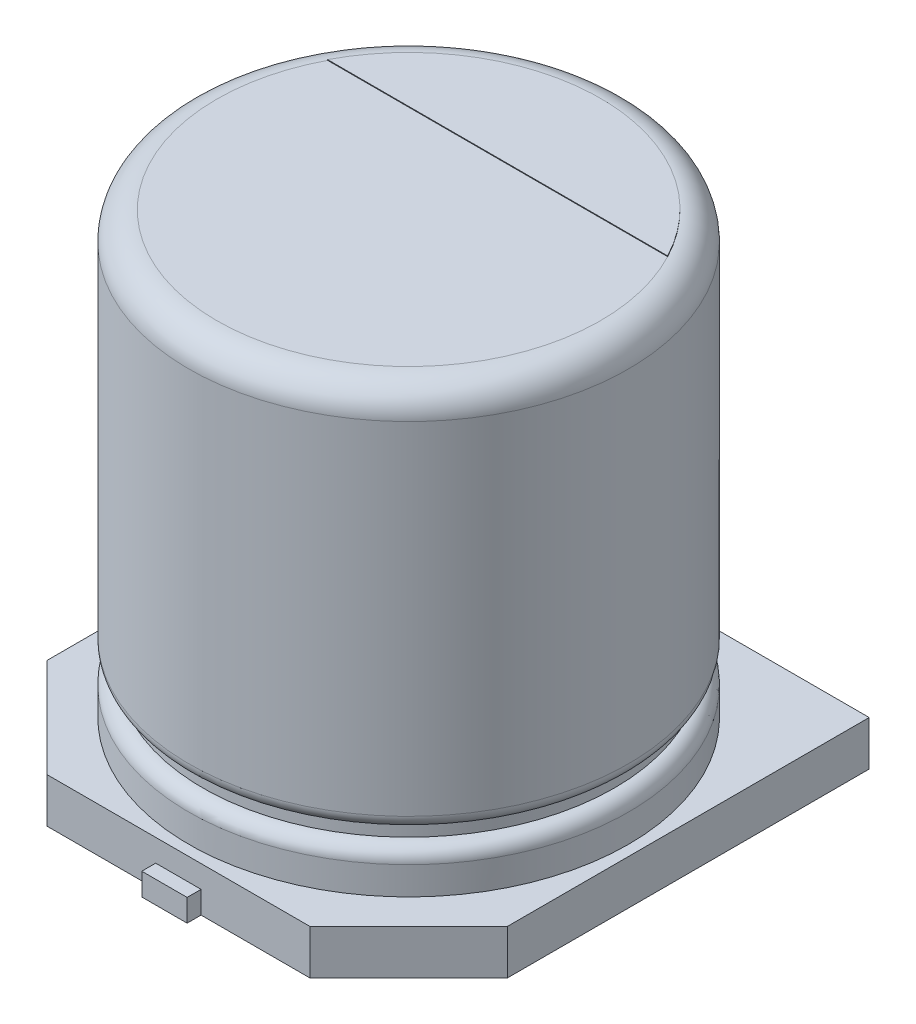
ISO-10303-21;
HEADER;
FILE_DESCRIPTION(('STEP AP214'),'2;1');
FILE_NAME('part.step','',(''),(''),'','','');
FILE_SCHEMA(('AUTOMOTIVE_DESIGN { 1 0 10303 214 1 1 1 1 }'));
ENDSEC;
DATA;
#1=APPLICATION_CONTEXT('core data for automotive mechanical design processes');
#2=APPLICATION_PROTOCOL_DEFINITION('international standard','automotive_design',2000,#1);
#3=PRODUCT_CONTEXT('',#1,'mechanical');
#4=PRODUCT('Part','Part','',(#3));
#5=PRODUCT_RELATED_PRODUCT_CATEGORY('part','',(#4));
#6=PRODUCT_DEFINITION_FORMATION('','',#4);
#7=PRODUCT_DEFINITION_CONTEXT('part definition',#1,'design');
#8=PRODUCT_DEFINITION('design','',#6,#7);
#9=PRODUCT_DEFINITION_SHAPE('','',#8);
#10=(LENGTH_UNIT() NAMED_UNIT(*) SI_UNIT(.MILLI.,.METRE.));
#11=(NAMED_UNIT(*) PLANE_ANGLE_UNIT() SI_UNIT($,.RADIAN.));
#12=(NAMED_UNIT(*) SI_UNIT($,.STERADIAN.) SOLID_ANGLE_UNIT());
#13=UNCERTAINTY_MEASURE_WITH_UNIT(LENGTH_MEASURE(1.E-05),#10,'distance_accuracy_value','');
#14=(GEOMETRIC_REPRESENTATION_CONTEXT(3) GLOBAL_UNCERTAINTY_ASSIGNED_CONTEXT((#13)) GLOBAL_UNIT_ASSIGNED_CONTEXT((#10,
#11,#12)) REPRESENTATION_CONTEXT('',''));
#15=CARTESIAN_POINT('',(0.,0.,0.));
#16=DIRECTION('',(0.,0.,1.));
#17=DIRECTION('',(1.,0.,0.));
#18=AXIS2_PLACEMENT_3D('',#15,#16,#17);
#19=CARTESIAN_POINT('',(0.,-0.64,0.));
#20=DIRECTION('',(0.,-1.,0.));
#21=DIRECTION('',(1.,0.,0.));
#22=AXIS2_PLACEMENT_3D('',#19,#20,#21);
#23=PLANE('',#22);
#24=DIRECTION('',(-1.,0.,0.));
#25=VECTOR('',#24,1.);
#26=CARTESIAN_POINT('',(1.88578643762691,-0.64,3.3));
#27=LINE('',#26,#25);
#28=CARTESIAN_POINT('',(1.88578643762691,-0.64,3.3));
#29=VERTEX_POINT('',#28);
#30=CARTESIAN_POINT('',(0.325,-0.64,3.3));
#31=VERTEX_POINT('',#30);
#32=EDGE_CURVE('E238',#29,#31,#27,.T.);
#33=ORIENTED_EDGE('',*,*,#32,.T.);
#34=DIRECTION('',(0.,0.,-1.));
#35=VECTOR('',#34,1.);
#36=CARTESIAN_POINT('',(0.324999999999999,-0.64,0.));
#37=LINE('',#36,#35);
#38=CARTESIAN_POINT('',(0.325,-0.64,0.9));
#39=VERTEX_POINT('',#38);
#40=EDGE_CURVE('E11',#31,#39,#37,.T.);
#41=ORIENTED_EDGE('',*,*,#40,.T.);
#42=DIRECTION('',(-1.,0.,0.));
#43=VECTOR('',#42,1.);
#44=CARTESIAN_POINT('',(0.,-0.64,0.9));
#45=LINE('',#44,#43);
#46=CARTESIAN_POINT('',(-0.325,-0.64,0.9));
#47=VERTEX_POINT('',#46);
#48=EDGE_CURVE('E45',#39,#47,#45,.T.);
#49=ORIENTED_EDGE('',*,*,#48,.T.);
#50=DIRECTION('',(0.,0.,1.));
#51=VECTOR('',#50,1.);
#52=CARTESIAN_POINT('',(-0.325,-0.64,0.));
#53=LINE('',#52,#51);
#54=CARTESIAN_POINT('',(-0.324999999999999,-0.64,3.3));
#55=VERTEX_POINT('',#54);
#56=EDGE_CURVE('E317',#47,#55,#53,.T.);
#57=ORIENTED_EDGE('',*,*,#56,.T.);
#58=CARTESIAN_POINT('',(-1.88578643762691,-0.64,3.3));
#59=VERTEX_POINT('',#58);
#60=EDGE_CURVE('E237',#55,#59,#27,.T.);
#61=ORIENTED_EDGE('',*,*,#60,.T.);
#62=DIRECTION('',(-0.707106781186546,0.,-0.707106781186549));
#63=VECTOR('',#62,1.);
#64=CARTESIAN_POINT('',(-1.88578643762691,-0.64,3.3));
#65=LINE('',#64,#63);
#66=CARTESIAN_POINT('',(-3.3,-0.64,1.8857864376269));
#67=VERTEX_POINT('',#66);
#68=EDGE_CURVE('E240',#59,#67,#65,.T.);
#69=ORIENTED_EDGE('',*,*,#68,.T.);
#70=DIRECTION('',(0.,0.,-1.));
#71=VECTOR('',#70,1.);
#72=CARTESIAN_POINT('',(-3.3,-0.64,1.8857864376269));
#73=LINE('',#72,#71);
#74=CARTESIAN_POINT('',(-3.3,-0.64,-3.3));
#75=VERTEX_POINT('',#74);
#76=EDGE_CURVE('E225',#67,#75,#73,.T.);
#77=ORIENTED_EDGE('',*,*,#76,.T.);
#78=DIRECTION('',(1.,0.,0.));
#79=VECTOR('',#78,1.);
#80=CARTESIAN_POINT('',(-3.3,-0.64,-3.3));
#81=LINE('',#80,#79);
#82=CARTESIAN_POINT('',(-0.324999999999999,-0.64,-3.3));
#83=VERTEX_POINT('',#82);
#84=EDGE_CURVE('E230',#75,#83,#81,.T.);
#85=ORIENTED_EDGE('',*,*,#84,.T.);
#86=DIRECTION('',(0.,0.,1.));
#87=VECTOR('',#86,1.);
#88=CARTESIAN_POINT('',(-0.325,-0.64,0.));
#89=LINE('',#88,#87);
#90=CARTESIAN_POINT('',(-0.325,-0.64,-0.9));
#91=VERTEX_POINT('',#90);
#92=EDGE_CURVE('E314',#83,#91,#89,.T.);
#93=ORIENTED_EDGE('',*,*,#92,.T.);
#94=DIRECTION('',(1.,0.,0.));
#95=VECTOR('',#94,1.);
#96=CARTESIAN_POINT('',(0.,-0.64,-0.9));
#97=LINE('',#96,#95);
#98=CARTESIAN_POINT('',(0.325,-0.64,-0.9));
#99=VERTEX_POINT('',#98);
#100=EDGE_CURVE('E307',#91,#99,#97,.T.);
#101=ORIENTED_EDGE('',*,*,#100,.T.);
#102=DIRECTION('',(0.,0.,-1.));
#103=VECTOR('',#102,1.);
#104=CARTESIAN_POINT('',(0.324999999999999,-0.64,0.));
#105=LINE('',#104,#103);
#106=CARTESIAN_POINT('',(0.325,-0.64,-3.3));
#107=VERTEX_POINT('',#106);
#108=EDGE_CURVE('E311',#99,#107,#105,.T.);
#109=ORIENTED_EDGE('',*,*,#108,.T.);
#110=CARTESIAN_POINT('',(3.3,-0.64,-3.3));
#111=VERTEX_POINT('',#110);
#112=EDGE_CURVE('E228',#107,#111,#81,.T.);
#113=ORIENTED_EDGE('',*,*,#112,.T.);
#114=DIRECTION('',(0.,0.,1.));
#115=VECTOR('',#114,1.);
#116=CARTESIAN_POINT('',(3.3,-0.64,-3.3));
#117=LINE('',#116,#115);
#118=CARTESIAN_POINT('',(3.3,-0.64,1.8857864376269));
#119=VERTEX_POINT('',#118);
#120=EDGE_CURVE('E233',#111,#119,#117,.T.);
#121=ORIENTED_EDGE('',*,*,#120,.T.);
#122=DIRECTION('',(-0.707106781186546,0.,0.707106781186549));
#123=VECTOR('',#122,1.);
#124=CARTESIAN_POINT('',(3.3,-0.64,1.8857864376269));
#125=LINE('',#124,#123);
#126=EDGE_CURVE('E235',#119,#29,#125,.T.);
#127=ORIENTED_EDGE('',*,*,#126,.T.);
#128=EDGE_LOOP('',(#33,#41,#49,#57,#61,#69,#77,#85,#93,#101,#109,#113,#121,#127));
#129=FACE_BOUND('',#128,.T.);
#130=ADVANCED_FACE('F36',(#129),#23,.T.);
#131=ORIENTED_EDGE('',*,*,#40,.F.);
#132=DIRECTION('',(0.,0.,1.));
#133=VECTOR('',#132,1.);
#134=CARTESIAN_POINT('',(0.325,-0.64,0.9));
#135=LINE('',#134,#133);
#136=CARTESIAN_POINT('',(0.325,-0.64,3.5));
#137=VERTEX_POINT('',#136);
#138=EDGE_CURVE('E156',#31,#137,#135,.T.);
#139=ORIENTED_EDGE('',*,*,#138,.T.);
#140=DIRECTION('',(-1.,0.,0.));
#141=VECTOR('',#140,1.);
#142=CARTESIAN_POINT('',(-0.324999999999999,-0.64,3.5));
#143=LINE('',#142,#141);
#144=CARTESIAN_POINT('',(-0.324999999999999,-0.64,3.5));
#145=VERTEX_POINT('',#144);
#146=EDGE_CURVE('E161',#137,#145,#143,.T.);
#147=ORIENTED_EDGE('',*,*,#146,.T.);
#148=DIRECTION('',(0.,0.,-1.));
#149=VECTOR('',#148,1.);
#150=CARTESIAN_POINT('',(-0.325,-0.64,0.9));
#151=LINE('',#150,#149);
#152=EDGE_CURVE('E180',#145,#55,#151,.T.);
#153=ORIENTED_EDGE('',*,*,#152,.T.);
#154=ORIENTED_EDGE('',*,*,#56,.F.);
#155=ORIENTED_EDGE('',*,*,#48,.F.);
#156=EDGE_LOOP('',(#131,#139,#147,#153,#154,#155));
#157=FACE_BOUND('',#156,.T.);
#158=ADVANCED_FACE('F158',(#157),#23,.T.);
#159=ORIENTED_EDGE('',*,*,#92,.F.);
#160=DIRECTION('',(0.,0.,-1.));
#161=VECTOR('',#160,1.);
#162=CARTESIAN_POINT('',(-0.325,-0.64,-0.9));
#163=LINE('',#162,#161);
#164=CARTESIAN_POINT('',(-0.324999999999999,-0.64,-3.5));
#165=VERTEX_POINT('',#164);
#166=EDGE_CURVE('E190',#83,#165,#163,.T.);
#167=ORIENTED_EDGE('',*,*,#166,.T.);
#168=DIRECTION('',(1.,0.,0.));
#169=VECTOR('',#168,1.);
#170=CARTESIAN_POINT('',(-0.324999999999999,-0.64,-3.5));
#171=LINE('',#170,#169);
#172=CARTESIAN_POINT('',(0.325,-0.64,-3.5));
#173=VERTEX_POINT('',#172);
#174=EDGE_CURVE('E192',#165,#173,#171,.T.);
#175=ORIENTED_EDGE('',*,*,#174,.T.);
#176=DIRECTION('',(0.,0.,1.));
#177=VECTOR('',#176,1.);
#178=CARTESIAN_POINT('',(0.325,-0.64,-0.9));
#179=LINE('',#178,#177);
#180=EDGE_CURVE('E195',#173,#107,#179,.T.);
#181=ORIENTED_EDGE('',*,*,#180,.T.);
#182=ORIENTED_EDGE('',*,*,#108,.F.);
#183=ORIENTED_EDGE('',*,*,#100,.F.);
#184=EDGE_LOOP('',(#159,#167,#175,#181,#182,#183));
#185=FACE_BOUND('',#184,.T.);
#186=ADVANCED_FACE('F372',(#185),#23,.T.);
#187=CARTESIAN_POINT('',(1.88578643762691,-0.64,3.3));
#188=DIRECTION('',(0.,0.,-1.));
#189=DIRECTION('',(-1.,0.,0.));
#190=AXIS2_PLACEMENT_3D('',#187,#188,#189);
#191=PLANE('',#190);
#192=DIRECTION('',(0.,-1.,0.));
#193=VECTOR('',#192,1.);
#194=CARTESIAN_POINT('',(-0.325,-0.32,3.3));
#195=LINE('',#194,#193);
#196=CARTESIAN_POINT('',(-0.324999999999999,-0.32,3.3));
#197=VERTEX_POINT('',#196);
#198=EDGE_CURVE('E212',#197,#55,#195,.T.);
#199=ORIENTED_EDGE('',*,*,#198,.F.);
#200=DIRECTION('',(-1.,0.,0.));
#201=VECTOR('',#200,1.);
#202=CARTESIAN_POINT('',(0.,-0.32,3.3));
#203=LINE('',#202,#201);
#204=CARTESIAN_POINT('',(0.325,-0.32,3.3));
#205=VERTEX_POINT('',#204);
#206=EDGE_CURVE('E209',#205,#197,#203,.T.);
#207=ORIENTED_EDGE('',*,*,#206,.F.);
#208=DIRECTION('',(0.,-1.,0.));
#209=VECTOR('',#208,1.);
#210=CARTESIAN_POINT('',(0.324999999999999,-0.32,3.3));
#211=LINE('',#210,#209);
#212=EDGE_CURVE('E211',#205,#31,#211,.T.);
#213=ORIENTED_EDGE('',*,*,#212,.T.);
#214=ORIENTED_EDGE('',*,*,#32,.F.);
#215=DIRECTION('',(0.,1.,0.));
#216=VECTOR('',#215,1.);
#217=CARTESIAN_POINT('',(1.88578643762691,-0.64,3.3));
#218=LINE('',#217,#216);
#219=CARTESIAN_POINT('',(1.88578643762691,0.,3.3));
#220=VERTEX_POINT('',#219);
#221=EDGE_CURVE('E259',#29,#220,#218,.T.);
#222=ORIENTED_EDGE('',*,*,#221,.T.);
#223=DIRECTION('',(-1.,0.,0.));
#224=VECTOR('',#223,1.);
#225=CARTESIAN_POINT('',(1.88578643762691,0.,3.3));
#226=LINE('',#225,#224);
#227=CARTESIAN_POINT('',(-1.88578643762691,0.,3.3));
#228=VERTEX_POINT('',#227);
#229=EDGE_CURVE('E251',#220,#228,#226,.T.);
#230=ORIENTED_EDGE('',*,*,#229,.T.);
#231=DIRECTION('',(0.,1.,0.));
#232=VECTOR('',#231,1.);
#233=CARTESIAN_POINT('',(-1.88578643762691,-0.64,3.3));
#234=LINE('',#233,#232);
#235=EDGE_CURVE('E256',#59,#228,#234,.T.);
#236=ORIENTED_EDGE('',*,*,#235,.F.);
#237=ORIENTED_EDGE('',*,*,#60,.F.);
#238=EDGE_LOOP('',(#199,#207,#213,#214,#222,#230,#236,#237));
#239=FACE_BOUND('',#238,.T.);
#240=ADVANCED_FACE('F340',(#239),#191,.F.);
#241=CARTESIAN_POINT('',(-3.3,-0.64,-3.3));
#242=DIRECTION('',(0.,0.,1.));
#243=DIRECTION('',(1.,0.,0.));
#244=AXIS2_PLACEMENT_3D('',#241,#242,#243);
#245=PLANE('',#244);
#246=DIRECTION('',(0.,-1.,0.));
#247=VECTOR('',#246,1.);
#248=CARTESIAN_POINT('',(0.325,-0.32,-3.3));
#249=LINE('',#248,#247);
#250=CARTESIAN_POINT('',(0.325,-0.32,-3.3));
#251=VERTEX_POINT('',#250);
#252=EDGE_CURVE('E219',#251,#107,#249,.T.);
#253=ORIENTED_EDGE('',*,*,#252,.F.);
#254=DIRECTION('',(1.,0.,0.));
#255=VECTOR('',#254,1.);
#256=CARTESIAN_POINT('',(0.,-0.32,-3.3));
#257=LINE('',#256,#255);
#258=CARTESIAN_POINT('',(-0.324999999999999,-0.32,-3.3));
#259=VERTEX_POINT('',#258);
#260=EDGE_CURVE('E215',#259,#251,#257,.T.);
#261=ORIENTED_EDGE('',*,*,#260,.F.);
#262=DIRECTION('',(0.,-1.,0.));
#263=VECTOR('',#262,1.);
#264=CARTESIAN_POINT('',(-0.325,-0.32,-3.3));
#265=LINE('',#264,#263);
#266=EDGE_CURVE('E218',#259,#83,#265,.T.);
#267=ORIENTED_EDGE('',*,*,#266,.T.);
#268=ORIENTED_EDGE('',*,*,#84,.F.);
#269=DIRECTION('',(0.,1.,0.));
#270=VECTOR('',#269,1.);
#271=CARTESIAN_POINT('',(-3.3,-0.64,-3.3));
#272=LINE('',#271,#270);
#273=CARTESIAN_POINT('',(-3.3,0.,-3.3));
#274=VERTEX_POINT('',#273);
#275=EDGE_CURVE('E268',#75,#274,#272,.T.);
#276=ORIENTED_EDGE('',*,*,#275,.T.);
#277=DIRECTION('',(1.,0.,0.));
#278=VECTOR('',#277,1.);
#279=CARTESIAN_POINT('',(-3.3,0.,-3.3));
#280=LINE('',#279,#278);
#281=CARTESIAN_POINT('',(3.3,0.,-3.3));
#282=VERTEX_POINT('',#281);
#283=EDGE_CURVE('E245',#274,#282,#280,.T.);
#284=ORIENTED_EDGE('',*,*,#283,.T.);
#285=DIRECTION('',(0.,1.,0.));
#286=VECTOR('',#285,1.);
#287=CARTESIAN_POINT('',(3.3,-0.64,-3.3));
#288=LINE('',#287,#286);
#289=EDGE_CURVE('E265',#111,#282,#288,.T.);
#290=ORIENTED_EDGE('',*,*,#289,.F.);
#291=ORIENTED_EDGE('',*,*,#112,.F.);
#292=EDGE_LOOP('',(#253,#261,#267,#268,#276,#284,#290,#291));
#293=FACE_BOUND('',#292,.T.);
#294=ADVANCED_FACE('F354',(#293),#245,.F.);
#295=CARTESIAN_POINT('',(0.,6.3,0.));
#296=DIRECTION('',(0.,1.,0.));
#297=DIRECTION('',(-1.,0.,0.));
#298=AXIS2_PLACEMENT_3D('',#295,#296,#297);
#299=PLANE('',#298);
#300=CARTESIAN_POINT('',(0.,6.3,0.));
#301=DIRECTION('',(0.,1.,0.));
#302=DIRECTION('',(-1.,0.,0.));
#303=AXIS2_PLACEMENT_3D('',#300,#301,#302);
#304=CIRCLE('',#303,2.75);
#305=CARTESIAN_POINT('',(-2.43657033553312,6.3,-1.275));
#306=VERTEX_POINT('',#305);
#307=CARTESIAN_POINT('',(2.43657033553312,6.3,-1.275));
#308=VERTEX_POINT('',#307);
#309=EDGE_CURVE('E303',#306,#308,#304,.T.);
#310=ORIENTED_EDGE('',*,*,#309,.T.);
#311=DIRECTION('',(1.,0.,0.));
#312=VECTOR('',#311,1.);
#313=CARTESIAN_POINT('',(-2.43657033553312,6.3,-1.275));
#314=LINE('',#313,#312);
#315=EDGE_CURVE('E274',#306,#308,#314,.T.);
#316=ORIENTED_EDGE('',*,*,#315,.F.);
#317=EDGE_LOOP('',(#310,#316));
#318=FACE_BOUND('',#317,.T.);
#319=ADVANCED_FACE('F38',(#318),#299,.T.);
#320=CARTESIAN_POINT('',(0.,5.9,0.));
#321=DIRECTION('',(0.,1.,0.));
#322=DIRECTION('',(-1.,0.,0.));
#323=AXIS2_PLACEMENT_3D('',#320,#321,#322);
#324=TOROIDAL_SURFACE('',#323,2.75,0.400000000000001);
#325=CARTESIAN_POINT('',(0.,5.9,0.));
#326=DIRECTION('',(0.,1.,0.));
#327=DIRECTION('',(-1.,0.,0.));
#328=AXIS2_PLACEMENT_3D('',#325,#326,#327);
#329=CIRCLE('',#328,3.15);
#330=CARTESIAN_POINT('',(-3.15,5.9,0.));
#331=VERTEX_POINT('',#330);
#332=EDGE_CURVE('E300',#331,#331,#329,.T.);
#333=ORIENTED_EDGE('',*,*,#332,.T.);
#334=EDGE_LOOP('',(#333));
#335=FACE_BOUND('',#334,.T.);
#336=EDGE_CURVE('E304',#308,#306,#304,.T.);
#337=ORIENTED_EDGE('',*,*,#336,.F.);
#338=ORIENTED_EDGE('',*,*,#309,.F.);
#339=EDGE_LOOP('',(#337,#338));
#340=FACE_BOUND('',#339,.T.);
#341=ADVANCED_FACE('F453',(#335,#340),#324,.T.);
#342=CARTESIAN_POINT('',(0.,8.08222988146831,0.));
#343=DIRECTION('',(0.,1.,0.));
#344=DIRECTION('',(-1.,0.,0.));
#345=AXIS2_PLACEMENT_3D('',#342,#343,#344);
#346=CYLINDRICAL_SURFACE('',#345,3.15);
#347=CARTESIAN_POINT('',(0.,1.,0.));
#348=DIRECTION('',(0.,1.,0.));
#349=DIRECTION('',(-1.,0.,0.));
#350=AXIS2_PLACEMENT_3D('',#347,#348,#349);
#351=CIRCLE('',#350,3.15);
#352=CARTESIAN_POINT('',(-3.15,1.,0.));
#353=VERTEX_POINT('',#352);
#354=EDGE_CURVE('E297',#353,#353,#351,.T.);
#355=ORIENTED_EDGE('',*,*,#354,.T.);
#356=EDGE_LOOP('',(#355));
#357=FACE_BOUND('',#356,.T.);
#358=ORIENTED_EDGE('',*,*,#332,.F.);
#359=EDGE_LOOP('',(#358));
#360=FACE_BOUND('',#359,.T.);
#361=ADVANCED_FACE('F450',(#357,#360),#346,.T.);
#362=CARTESIAN_POINT('',(0.,1.,0.));
#363=DIRECTION('',(0.,1.,0.));
#364=DIRECTION('',(-1.,0.,0.));
#365=AXIS2_PLACEMENT_3D('',#362,#363,#364);
#366=TOROIDAL_SURFACE('',#365,2.95,0.2);
#367=CARTESIAN_POINT('',(0.,0.8,0.));
#368=DIRECTION('',(0.,1.,0.));
#369=DIRECTION('',(-1.,0.,0.));
#370=AXIS2_PLACEMENT_3D('',#367,#368,#369);
#371=CIRCLE('',#370,2.95);
#372=CARTESIAN_POINT('',(-2.95,0.8,0.));
#373=VERTEX_POINT('',#372);
#374=EDGE_CURVE('E294',#373,#373,#371,.T.);
#375=ORIENTED_EDGE('',*,*,#374,.T.);
#376=EDGE_LOOP('',(#375));
#377=FACE_BOUND('',#376,.T.);
#378=ORIENTED_EDGE('',*,*,#354,.F.);
#379=EDGE_LOOP('',(#378));
#380=FACE_BOUND('',#379,.T.);
#381=ADVANCED_FACE('F446',(#377,#380),#366,.T.);
#382=CARTESIAN_POINT('',(0.,8.08222988146831,0.));
#383=DIRECTION('',(0.,1.,0.));
#384=DIRECTION('',(-1.,0.,0.));
#385=AXIS2_PLACEMENT_3D('',#382,#383,#384);
#386=CYLINDRICAL_SURFACE('',#385,2.95);
#387=CARTESIAN_POINT('',(0.,0.6,0.));
#388=DIRECTION('',(0.,1.,0.));
#389=DIRECTION('',(-1.,0.,0.));
#390=AXIS2_PLACEMENT_3D('',#387,#388,#389);
#391=CIRCLE('',#390,2.95);
#392=CARTESIAN_POINT('',(-2.95,0.6,0.));
#393=VERTEX_POINT('',#392);
#394=EDGE_CURVE('E291',#393,#393,#391,.T.);
#395=ORIENTED_EDGE('',*,*,#394,.T.);
#396=EDGE_LOOP('',(#395));
#397=FACE_BOUND('',#396,.T.);
#398=ORIENTED_EDGE('',*,*,#374,.F.);
#399=EDGE_LOOP('',(#398));
#400=FACE_BOUND('',#399,.T.);
#401=ADVANCED_FACE('F442',(#397,#400),#386,.T.);
#402=CARTESIAN_POINT('',(0.,0.4,0.));
#403=DIRECTION('',(0.,1.,0.));
#404=DIRECTION('',(-1.,0.,0.));
#405=AXIS2_PLACEMENT_3D('',#402,#403,#404);
#406=TOROIDAL_SURFACE('',#405,2.95,0.2);
#407=CARTESIAN_POINT('',(0.,0.4,0.));
#408=DIRECTION('',(0.,1.,0.));
#409=DIRECTION('',(-1.,0.,0.));
#410=AXIS2_PLACEMENT_3D('',#407,#408,#409);
#411=CIRCLE('',#410,3.15);
#412=CARTESIAN_POINT('',(-3.15,0.4,0.));
#413=VERTEX_POINT('',#412);
#414=EDGE_CURVE('E288',#413,#413,#411,.T.);
#415=ORIENTED_EDGE('',*,*,#414,.T.);
#416=EDGE_LOOP('',(#415));
#417=FACE_BOUND('',#416,.T.);
#418=ORIENTED_EDGE('',*,*,#394,.F.);
#419=EDGE_LOOP('',(#418));
#420=FACE_BOUND('',#419,.T.);
#421=ADVANCED_FACE('F438',(#417,#420),#406,.T.);
#422=CARTESIAN_POINT('',(0.,8.08222988146831,0.));
#423=DIRECTION('',(0.,1.,0.));
#424=DIRECTION('',(-1.,0.,0.));
#425=AXIS2_PLACEMENT_3D('',#422,#423,#424);
#426=CYLINDRICAL_SURFACE('',#425,3.15);
#427=CARTESIAN_POINT('',(0.,0.,0.));
#428=DIRECTION('',(0.,-1.,0.));
#429=DIRECTION('',(1.,0.,0.));
#430=AXIS2_PLACEMENT_3D('',#427,#428,#429);
#431=CIRCLE('',#430,3.15);
#432=CARTESIAN_POINT('',(3.15,0.,0.));
#433=VERTEX_POINT('',#432);
#434=EDGE_CURVE('E271',#433,#433,#431,.F.);
#435=ORIENTED_EDGE('',*,*,#434,.T.);
#436=EDGE_LOOP('',(#435));
#437=FACE_BOUND('',#436,.T.);
#438=ORIENTED_EDGE('',*,*,#414,.F.);
#439=EDGE_LOOP('',(#438));
#440=FACE_BOUND('',#439,.T.);
#441=ADVANCED_FACE('F434',(#437,#440),#426,.T.);
#442=CARTESIAN_POINT('',(0.,6.31,0.));
#443=DIRECTION('',(0.,-1.,0.));
#444=DIRECTION('',(1.,0.,0.));
#445=AXIS2_PLACEMENT_3D('',#442,#443,#444);
#446=CYLINDRICAL_SURFACE('',#445,2.75);
#447=ORIENTED_EDGE('',*,*,#336,.T.);
#448=DIRECTION('',(0.,-1.,0.));
#449=VECTOR('',#448,1.);
#450=CARTESIAN_POINT('',(-2.43657033553312,6.31,-1.275));
#451=LINE('',#450,#449);
#452=CARTESIAN_POINT('',(-2.43657033553312,6.31,-1.275));
#453=VERTEX_POINT('',#452);
#454=EDGE_CURVE('E285',#453,#306,#451,.T.);
#455=ORIENTED_EDGE('',*,*,#454,.F.);
#456=CARTESIAN_POINT('',(0.,6.31,0.));
#457=DIRECTION('',(0.,1.,0.));
#458=DIRECTION('',(-1.,0.,0.));
#459=AXIS2_PLACEMENT_3D('',#456,#457,#458);
#460=CIRCLE('',#459,2.75);
#461=CARTESIAN_POINT('',(2.43657033553312,6.31,-1.275));
#462=VERTEX_POINT('',#461);
#463=EDGE_CURVE('E275',#462,#453,#460,.T.);
#464=ORIENTED_EDGE('',*,*,#463,.F.);
#465=DIRECTION('',(0.,-1.,0.));
#466=VECTOR('',#465,1.);
#467=CARTESIAN_POINT('',(2.43657033553312,6.31,-1.275));
#468=LINE('',#467,#466);
#469=EDGE_CURVE('E280',#462,#308,#468,.T.);
#470=ORIENTED_EDGE('',*,*,#469,.T.);
#471=EDGE_LOOP('',(#447,#455,#464,#470));
#472=FACE_BOUND('',#471,.T.);
#473=ADVANCED_FACE('F430',(#472),#446,.T.);
#474=CARTESIAN_POINT('',(-2.43657033553312,6.31,-1.275));
#475=DIRECTION('',(0.,0.,-1.));
#476=DIRECTION('',(-1.,0.,0.));
#477=AXIS2_PLACEMENT_3D('',#474,#475,#476);
#478=PLANE('',#477);
#479=ORIENTED_EDGE('',*,*,#315,.T.);
#480=ORIENTED_EDGE('',*,*,#469,.F.);
#481=DIRECTION('',(1.,0.,0.));
#482=VECTOR('',#481,1.);
#483=CARTESIAN_POINT('',(-2.43657033553312,6.31,-1.275));
#484=LINE('',#483,#482);
#485=EDGE_CURVE('E278',#453,#462,#484,.T.);
#486=ORIENTED_EDGE('',*,*,#485,.F.);
#487=ORIENTED_EDGE('',*,*,#454,.T.);
#488=EDGE_LOOP('',(#479,#480,#486,#487));
#489=FACE_BOUND('',#488,.T.);
#490=ADVANCED_FACE('F426',(#489),#478,.F.);
#491=CARTESIAN_POINT('',(0.,6.31,0.));
#492=DIRECTION('',(0.,1.,0.));
#493=DIRECTION('',(-1.,0.,0.));
#494=AXIS2_PLACEMENT_3D('',#491,#492,#493);
#495=PLANE('',#494);
#496=ORIENTED_EDGE('',*,*,#463,.T.);
#497=ORIENTED_EDGE('',*,*,#485,.T.);
#498=EDGE_LOOP('',(#496,#497));
#499=FACE_BOUND('',#498,.T.);
#500=ADVANCED_FACE('F423',(#499),#495,.T.);
#501=CARTESIAN_POINT('',(-3.3,-0.64,1.8857864376269));
#502=DIRECTION('',(1.,0.,0.));
#503=DIRECTION('',(0.,1.,0.));
#504=AXIS2_PLACEMENT_3D('',#501,#502,#503);
#505=PLANE('',#504);
#506=DIRECTION('',(0.,0.,-1.));
#507=VECTOR('',#506,1.);
#508=CARTESIAN_POINT('',(-3.3,0.,1.8857864376269));
#509=LINE('',#508,#507);
#510=CARTESIAN_POINT('',(-3.3,0.,1.8857864376269));
#511=VERTEX_POINT('',#510);
#512=EDGE_CURVE('E222',#511,#274,#509,.T.);
#513=ORIENTED_EDGE('',*,*,#512,.T.);
#514=ORIENTED_EDGE('',*,*,#275,.F.);
#515=ORIENTED_EDGE('',*,*,#76,.F.);
#516=DIRECTION('',(0.,1.,0.));
#517=VECTOR('',#516,1.);
#518=CARTESIAN_POINT('',(-3.3,-0.64,1.8857864376269));
#519=LINE('',#518,#517);
#520=EDGE_CURVE('E242',#67,#511,#519,.T.);
#521=ORIENTED_EDGE('',*,*,#520,.T.);
#522=EDGE_LOOP('',(#513,#514,#515,#521));
#523=FACE_BOUND('',#522,.T.);
#524=ADVANCED_FACE('F350',(#523),#505,.F.);
#525=CARTESIAN_POINT('',(3.3,-0.64,-3.3));
#526=DIRECTION('',(-1.,0.,0.));
#527=DIRECTION('',(0.,-1.,0.));
#528=AXIS2_PLACEMENT_3D('',#525,#526,#527);
#529=PLANE('',#528);
#530=DIRECTION('',(0.,0.,1.));
#531=VECTOR('',#530,1.);
#532=CARTESIAN_POINT('',(3.3,0.,-3.3));
#533=LINE('',#532,#531);
#534=CARTESIAN_POINT('',(3.3,0.,1.8857864376269));
#535=VERTEX_POINT('',#534);
#536=EDGE_CURVE('E247',#282,#535,#533,.T.);
#537=ORIENTED_EDGE('',*,*,#536,.T.);
#538=DIRECTION('',(0.,1.,0.));
#539=VECTOR('',#538,1.);
#540=CARTESIAN_POINT('',(3.3,-0.64,1.8857864376269));
#541=LINE('',#540,#539);
#542=EDGE_CURVE('E262',#119,#535,#541,.T.);
#543=ORIENTED_EDGE('',*,*,#542,.F.);
#544=ORIENTED_EDGE('',*,*,#120,.F.);
#545=ORIENTED_EDGE('',*,*,#289,.T.);
#546=EDGE_LOOP('',(#537,#543,#544,#545));
#547=FACE_BOUND('',#546,.T.);
#548=ADVANCED_FACE('F381',(#547),#529,.F.);
#549=CARTESIAN_POINT('',(3.3,-0.64,1.8857864376269));
#550=DIRECTION('',(-0.707106781186549,0.,-0.707106781186546));
#551=DIRECTION('',(-0.707106781186546,0.,0.707106781186549));
#552=AXIS2_PLACEMENT_3D('',#549,#550,#551);
#553=PLANE('',#552);
#554=DIRECTION('',(-0.707106781186546,0.,0.707106781186549));
#555=VECTOR('',#554,1.);
#556=CARTESIAN_POINT('',(3.3,0.,1.8857864376269));
#557=LINE('',#556,#555);
#558=EDGE_CURVE('E249',#535,#220,#557,.T.);
#559=ORIENTED_EDGE('',*,*,#558,.T.);
#560=ORIENTED_EDGE('',*,*,#221,.F.);
#561=ORIENTED_EDGE('',*,*,#126,.F.);
#562=ORIENTED_EDGE('',*,*,#542,.T.);
#563=EDGE_LOOP('',(#559,#560,#561,#562));
#564=FACE_BOUND('',#563,.T.);
#565=ADVANCED_FACE('F386',(#564),#553,.F.);
#566=CARTESIAN_POINT('',(-1.88578643762691,-0.64,3.3));
#567=DIRECTION('',(0.707106781186549,0.,-0.707106781186546));
#568=DIRECTION('',(-0.707106781186546,0.,-0.707106781186549));
#569=AXIS2_PLACEMENT_3D('',#566,#567,#568);
#570=PLANE('',#569);
#571=DIRECTION('',(-0.707106781186546,0.,-0.707106781186549));
#572=VECTOR('',#571,1.);
#573=CARTESIAN_POINT('',(-1.88578643762691,0.,3.3));
#574=LINE('',#573,#572);
#575=EDGE_CURVE('E229',#228,#511,#574,.T.);
#576=ORIENTED_EDGE('',*,*,#575,.T.);
#577=ORIENTED_EDGE('',*,*,#520,.F.);
#578=ORIENTED_EDGE('',*,*,#68,.F.);
#579=ORIENTED_EDGE('',*,*,#235,.T.);
#580=EDGE_LOOP('',(#576,#577,#578,#579));
#581=FACE_BOUND('',#580,.T.);
#582=ADVANCED_FACE('F346',(#581),#570,.F.);
#583=CARTESIAN_POINT('',(0.,0.,0.));
#584=DIRECTION('',(0.,-1.,0.));
#585=DIRECTION('',(1.,0.,0.));
#586=AXIS2_PLACEMENT_3D('',#583,#584,#585);
#587=PLANE('',#586);
#588=ORIENTED_EDGE('',*,*,#434,.F.);
#589=EDGE_LOOP('',(#588));
#590=FACE_BOUND('',#589,.T.);
#591=ORIENTED_EDGE('',*,*,#512,.F.);
#592=ORIENTED_EDGE('',*,*,#575,.F.);
#593=ORIENTED_EDGE('',*,*,#229,.F.);
#594=ORIENTED_EDGE('',*,*,#558,.F.);
#595=ORIENTED_EDGE('',*,*,#536,.F.);
#596=ORIENTED_EDGE('',*,*,#283,.F.);
#597=EDGE_LOOP('',(#591,#592,#593,#594,#595,#596));
#598=FACE_BOUND('',#597,.T.);
#599=ADVANCED_FACE('F489',(#590,#598),#587,.F.);
#600=CARTESIAN_POINT('',(0.,-0.32,0.));
#601=DIRECTION('',(0.,-1.,0.));
#602=DIRECTION('',(0.,0.,-1.));
#603=AXIS2_PLACEMENT_3D('',#600,#601,#602);
#604=PLANE('',#603);
#605=DIRECTION('',(0.,0.,-1.));
#606=VECTOR('',#605,1.);
#607=CARTESIAN_POINT('',(-0.325,-0.32,-0.9));
#608=LINE('',#607,#606);
#609=CARTESIAN_POINT('',(-0.324999999999999,-0.32,-3.5));
#610=VERTEX_POINT('',#609);
#611=EDGE_CURVE('E174',#259,#610,#608,.T.);
#612=ORIENTED_EDGE('',*,*,#611,.F.);
#613=ORIENTED_EDGE('',*,*,#260,.T.);
#614=DIRECTION('',(0.,0.,1.));
#615=VECTOR('',#614,1.);
#616=CARTESIAN_POINT('',(0.325,-0.32,-0.9));
#617=LINE('',#616,#615);
#618=CARTESIAN_POINT('',(0.325,-0.32,-3.5));
#619=VERTEX_POINT('',#618);
#620=EDGE_CURVE('E193',#619,#251,#617,.T.);
#621=ORIENTED_EDGE('',*,*,#620,.F.);
#622=DIRECTION('',(1.,0.,0.));
#623=VECTOR('',#622,1.);
#624=CARTESIAN_POINT('',(-0.324999999999999,-0.32,-3.5));
#625=LINE('',#624,#623);
#626=EDGE_CURVE('E200',#610,#619,#625,.T.);
#627=ORIENTED_EDGE('',*,*,#626,.F.);
#628=EDGE_LOOP('',(#612,#613,#621,#627));
#629=FACE_BOUND('',#628,.T.);
#630=ADVANCED_FACE('F364',(#629),#604,.F.);
#631=CARTESIAN_POINT('',(-0.325,-0.64,-0.9));
#632=DIRECTION('',(1.,0.,0.));
#633=DIRECTION('',(0.,0.,-1.));
#634=AXIS2_PLACEMENT_3D('',#631,#632,#633);
#635=PLANE('',#634);
#636=ORIENTED_EDGE('',*,*,#166,.F.);
#637=ORIENTED_EDGE('',*,*,#266,.F.);
#638=ORIENTED_EDGE('',*,*,#611,.T.);
#639=DIRECTION('',(0.,1.,0.));
#640=VECTOR('',#639,1.);
#641=CARTESIAN_POINT('',(-0.324999999999999,-0.64,-3.5));
#642=LINE('',#641,#640);
#643=EDGE_CURVE('E206',#165,#610,#642,.T.);
#644=ORIENTED_EDGE('',*,*,#643,.F.);
#645=EDGE_LOOP('',(#636,#637,#638,#644));
#646=FACE_BOUND('',#645,.T.);
#647=ADVANCED_FACE('F360',(#646),#635,.F.);
#648=CARTESIAN_POINT('',(0.325,-0.64,-0.9));
#649=DIRECTION('',(-1.,0.,0.));
#650=DIRECTION('',(0.,0.,1.));
#651=AXIS2_PLACEMENT_3D('',#648,#649,#650);
#652=PLANE('',#651);
#653=ORIENTED_EDGE('',*,*,#620,.T.);
#654=ORIENTED_EDGE('',*,*,#252,.T.);
#655=ORIENTED_EDGE('',*,*,#180,.F.);
#656=DIRECTION('',(0.,1.,0.));
#657=VECTOR('',#656,1.);
#658=CARTESIAN_POINT('',(0.325,-0.64,-3.5));
#659=LINE('',#658,#657);
#660=EDGE_CURVE('E198',#173,#619,#659,.T.);
#661=ORIENTED_EDGE('',*,*,#660,.T.);
#662=EDGE_LOOP('',(#653,#654,#655,#661));
#663=FACE_BOUND('',#662,.T.);
#664=ADVANCED_FACE('F376',(#663),#652,.F.);
#665=CARTESIAN_POINT('',(-0.324999999999999,-0.64,-3.5));
#666=DIRECTION('',(0.,0.,1.));
#667=DIRECTION('',(0.,-1.,0.));
#668=AXIS2_PLACEMENT_3D('',#665,#666,#667);
#669=PLANE('',#668);
#670=ORIENTED_EDGE('',*,*,#626,.T.);
#671=ORIENTED_EDGE('',*,*,#660,.F.);
#672=ORIENTED_EDGE('',*,*,#174,.F.);
#673=ORIENTED_EDGE('',*,*,#643,.T.);
#674=EDGE_LOOP('',(#670,#671,#672,#673));
#675=FACE_BOUND('',#674,.T.);
#676=ADVANCED_FACE('F369',(#675),#669,.F.);
#677=CARTESIAN_POINT('',(0.,-0.32,0.));
#678=DIRECTION('',(0.,-1.,0.));
#679=DIRECTION('',(0.,0.,-1.));
#680=AXIS2_PLACEMENT_3D('',#677,#678,#679);
#681=PLANE('',#680);
#682=DIRECTION('',(0.,0.,1.));
#683=VECTOR('',#682,1.);
#684=CARTESIAN_POINT('',(0.325,-0.32,0.9));
#685=LINE('',#684,#683);
#686=CARTESIAN_POINT('',(0.325,-0.32,3.5));
#687=VERTEX_POINT('',#686);
#688=EDGE_CURVE('E171',#205,#687,#685,.T.);
#689=ORIENTED_EDGE('',*,*,#688,.F.);
#690=ORIENTED_EDGE('',*,*,#206,.T.);
#691=DIRECTION('',(0.,0.,-1.));
#692=VECTOR('',#691,1.);
#693=CARTESIAN_POINT('',(-0.325,-0.32,0.9));
#694=LINE('',#693,#692);
#695=CARTESIAN_POINT('',(-0.324999999999999,-0.32,3.5));
#696=VERTEX_POINT('',#695);
#697=EDGE_CURVE('E165',#696,#197,#694,.T.);
#698=ORIENTED_EDGE('',*,*,#697,.F.);
#699=DIRECTION('',(-1.,0.,0.));
#700=VECTOR('',#699,1.);
#701=CARTESIAN_POINT('',(-0.324999999999999,-0.32,3.5));
#702=LINE('',#701,#700);
#703=EDGE_CURVE('E185',#687,#696,#702,.T.);
#704=ORIENTED_EDGE('',*,*,#703,.F.);
#705=EDGE_LOOP('',(#689,#690,#698,#704));
#706=FACE_BOUND('',#705,.T.);
#707=ADVANCED_FACE('F389',(#706),#681,.F.);
#708=CARTESIAN_POINT('',(0.325,-0.64,0.9));
#709=DIRECTION('',(-1.,0.,0.));
#710=DIRECTION('',(0.,0.,1.));
#711=AXIS2_PLACEMENT_3D('',#708,#709,#710);
#712=PLANE('',#711);
#713=ORIENTED_EDGE('',*,*,#138,.F.);
#714=ORIENTED_EDGE('',*,*,#212,.F.);
#715=ORIENTED_EDGE('',*,*,#688,.T.);
#716=DIRECTION('',(0.,1.,0.));
#717=VECTOR('',#716,1.);
#718=CARTESIAN_POINT('',(0.325,-0.64,3.5));
#719=LINE('',#718,#717);
#720=EDGE_CURVE('E168',#137,#687,#719,.T.);
#721=ORIENTED_EDGE('',*,*,#720,.F.);
#722=EDGE_LOOP('',(#713,#714,#715,#721));
#723=FACE_BOUND('',#722,.T.);
#724=ADVANCED_FACE('F169',(#723),#712,.F.);
#725=CARTESIAN_POINT('',(-0.325,-0.64,0.9));
#726=DIRECTION('',(1.,0.,0.));
#727=DIRECTION('',(0.,0.,-1.));
#728=AXIS2_PLACEMENT_3D('',#725,#726,#727);
#729=PLANE('',#728);
#730=ORIENTED_EDGE('',*,*,#697,.T.);
#731=ORIENTED_EDGE('',*,*,#198,.T.);
#732=ORIENTED_EDGE('',*,*,#152,.F.);
#733=DIRECTION('',(0.,1.,0.));
#734=VECTOR('',#733,1.);
#735=CARTESIAN_POINT('',(-0.324999999999999,-0.64,3.5));
#736=LINE('',#735,#734);
#737=EDGE_CURVE('E175',#145,#696,#736,.T.);
#738=ORIENTED_EDGE('',*,*,#737,.T.);
#739=EDGE_LOOP('',(#730,#731,#732,#738));
#740=FACE_BOUND('',#739,.T.);
#741=ADVANCED_FACE('F336',(#740),#729,.F.);
#742=CARTESIAN_POINT('',(-0.324999999999999,-0.64,3.5));
#743=DIRECTION('',(0.,0.,-1.));
#744=DIRECTION('',(0.,1.,0.));
#745=AXIS2_PLACEMENT_3D('',#742,#743,#744);
#746=PLANE('',#745);
#747=ORIENTED_EDGE('',*,*,#703,.T.);
#748=ORIENTED_EDGE('',*,*,#737,.F.);
#749=ORIENTED_EDGE('',*,*,#146,.F.);
#750=ORIENTED_EDGE('',*,*,#720,.T.);
#751=EDGE_LOOP('',(#747,#748,#749,#750));
#752=FACE_BOUND('',#751,.T.);
#753=ADVANCED_FACE('F177',(#752),#746,.F.);
#754=CLOSED_SHELL('',(#130,#158,#186,#240,#294,#319,#341,#361,#381,#401,#421,#441,#473,#490,
#500,#524,#548,#565,#582,#599,#630,#647,#664,#676,#707,#724,#741,#753));
#755=MANIFOLD_SOLID_BREP('B2',#754);
#756=ADVANCED_BREP_SHAPE_REPRESENTATION('',(#18,#755),#14);
#757=SHAPE_DEFINITION_REPRESENTATION(#9,#756);
ENDSEC;
END-ISO-10303-21;
